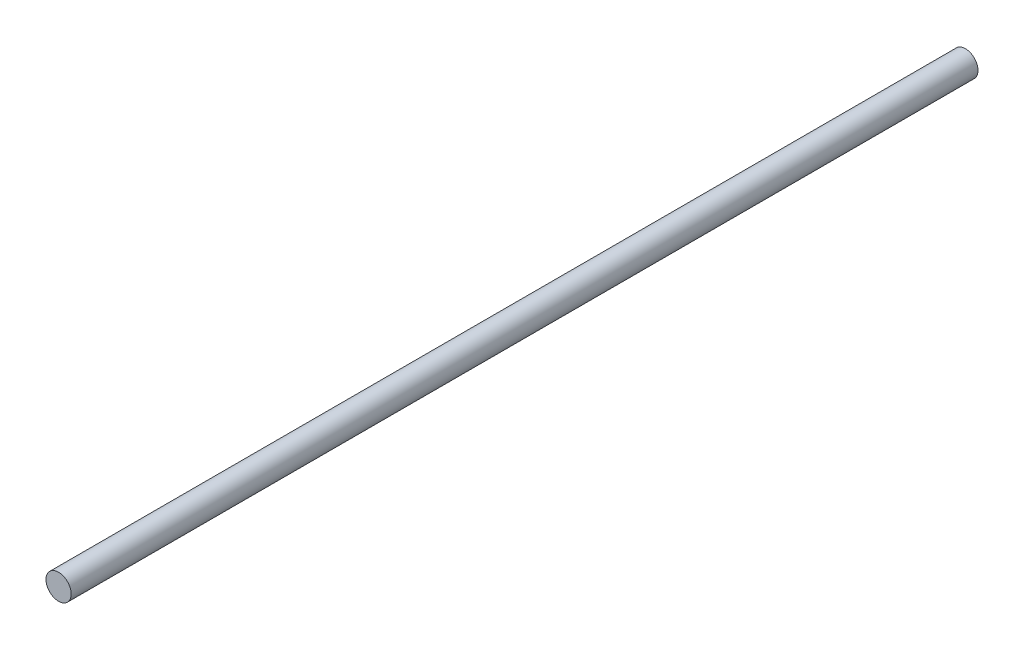
ISO-10303-21;
HEADER;
FILE_DESCRIPTION(('STEP AP214'),'2;1');
FILE_NAME('part.step','',(''),(''),'','','');
FILE_SCHEMA(('AUTOMOTIVE_DESIGN { 1 0 10303 214 1 1 1 1 }'));
ENDSEC;
DATA;
#1=APPLICATION_CONTEXT('core data for automotive mechanical design processes');
#2=APPLICATION_PROTOCOL_DEFINITION('international standard','automotive_design',2000,#1);
#3=PRODUCT_CONTEXT('',#1,'mechanical');
#4=PRODUCT('Part','Part','',(#3));
#5=PRODUCT_RELATED_PRODUCT_CATEGORY('part','',(#4));
#6=PRODUCT_DEFINITION_FORMATION('','',#4);
#7=PRODUCT_DEFINITION_CONTEXT('part definition',#1,'design');
#8=PRODUCT_DEFINITION('design','',#6,#7);
#9=PRODUCT_DEFINITION_SHAPE('','',#8);
#10=(LENGTH_UNIT() NAMED_UNIT(*) SI_UNIT(.MILLI.,.METRE.));
#11=(NAMED_UNIT(*) PLANE_ANGLE_UNIT() SI_UNIT($,.RADIAN.));
#12=(NAMED_UNIT(*) SI_UNIT($,.STERADIAN.) SOLID_ANGLE_UNIT());
#13=UNCERTAINTY_MEASURE_WITH_UNIT(LENGTH_MEASURE(1.E-05),#10,'distance_accuracy_value','');
#14=(GEOMETRIC_REPRESENTATION_CONTEXT(3) GLOBAL_UNCERTAINTY_ASSIGNED_CONTEXT((#13)) GLOBAL_UNIT_ASSIGNED_CONTEXT((#10,
#11,#12)) REPRESENTATION_CONTEXT('',''));
#15=CARTESIAN_POINT('',(0.,0.,0.));
#16=DIRECTION('',(0.,0.,1.));
#17=DIRECTION('',(1.,0.,0.));
#18=AXIS2_PLACEMENT_3D('',#15,#16,#17);
#19=CARTESIAN_POINT('',(0.,0.,457.2));
#20=DIRECTION('',(0.,0.,-1.));
#21=DIRECTION('',(-1.,0.,0.));
#22=AXIS2_PLACEMENT_3D('',#19,#20,#21);
#23=CYLINDRICAL_SURFACE('',#22,6.35);
#24=CARTESIAN_POINT('',(0.,0.,457.2));
#25=DIRECTION('',(0.,0.,1.));
#26=DIRECTION('',(1.,0.,0.));
#27=AXIS2_PLACEMENT_3D('',#24,#25,#26);
#28=CIRCLE('',#27,6.35);
#29=CARTESIAN_POINT('',(6.35,0.,457.2));
#30=VERTEX_POINT('',#29);
#31=EDGE_CURVE('E10',#30,#30,#28,.T.);
#32=ORIENTED_EDGE('',*,*,#31,.F.);
#33=EDGE_LOOP('',(#32));
#34=FACE_BOUND('',#33,.T.);
#35=CARTESIAN_POINT('',(0.,0.,0.));
#36=DIRECTION('',(0.,0.,1.));
#37=DIRECTION('',(1.,0.,0.));
#38=AXIS2_PLACEMENT_3D('',#35,#36,#37);
#39=CIRCLE('',#38,6.35);
#40=CARTESIAN_POINT('',(6.35,0.,0.));
#41=VERTEX_POINT('',#40);
#42=EDGE_CURVE('E37',#41,#41,#39,.T.);
#43=ORIENTED_EDGE('',*,*,#42,.T.);
#44=EDGE_LOOP('',(#43));
#45=FACE_BOUND('',#44,.T.);
#46=ADVANCED_FACE('F34',(#34,#45),#23,.T.);
#47=CARTESIAN_POINT('',(0.,0.,457.2));
#48=DIRECTION('',(0.,0.,1.));
#49=DIRECTION('',(1.,0.,0.));
#50=AXIS2_PLACEMENT_3D('',#47,#48,#49);
#51=PLANE('',#50);
#52=ORIENTED_EDGE('',*,*,#31,.T.);
#53=EDGE_LOOP('',(#52));
#54=FACE_BOUND('',#53,.T.);
#55=ADVANCED_FACE('F51',(#54),#51,.T.);
#56=CARTESIAN_POINT('',(0.,0.,0.));
#57=DIRECTION('',(0.,0.,1.));
#58=DIRECTION('',(1.,0.,0.));
#59=AXIS2_PLACEMENT_3D('',#56,#57,#58);
#60=PLANE('',#59);
#61=ORIENTED_EDGE('',*,*,#42,.F.);
#62=EDGE_LOOP('',(#61));
#63=FACE_BOUND('',#62,.T.);
#64=ADVANCED_FACE('F49',(#63),#60,.F.);
#65=CLOSED_SHELL('',(#46,#55,#64));
#66=MANIFOLD_SOLID_BREP('B2',#65);
#67=ADVANCED_BREP_SHAPE_REPRESENTATION('',(#18,#66),#14);
#68=SHAPE_DEFINITION_REPRESENTATION(#9,#67);
ENDSEC;
END-ISO-10303-21;
